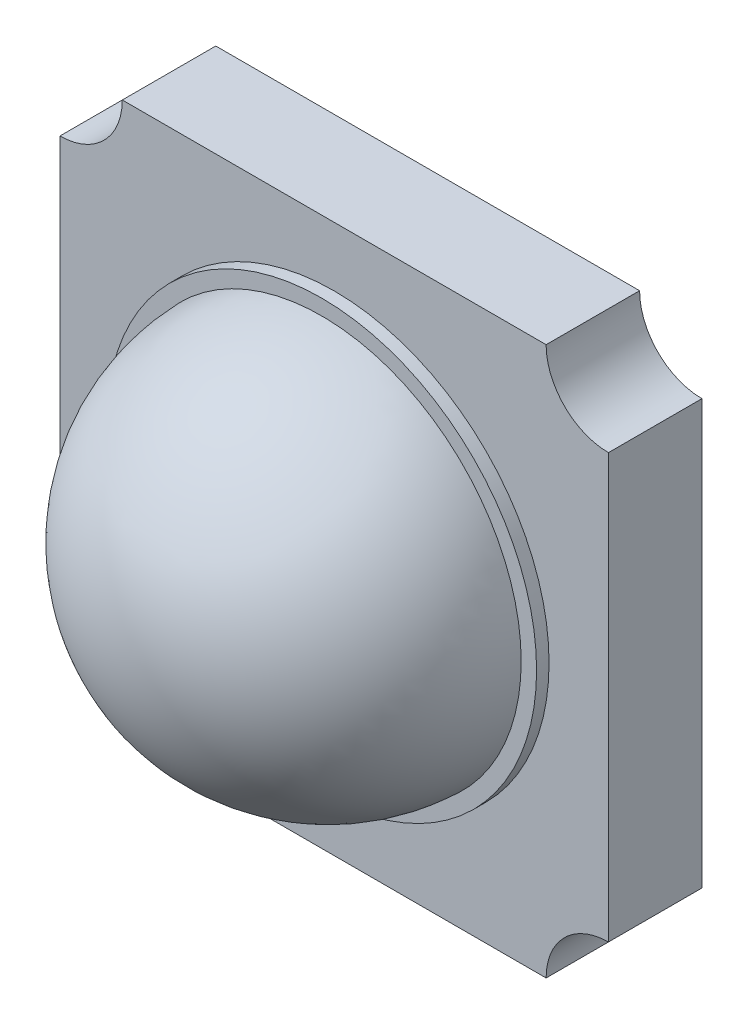
ISO-10303-21;
HEADER;
FILE_DESCRIPTION(('STEP AP214'),'2;1');
FILE_NAME('part.step','',(''),(''),'','','');
FILE_SCHEMA(('AUTOMOTIVE_DESIGN { 1 0 10303 214 1 1 1 1 }'));
ENDSEC;
DATA;
#1=APPLICATION_CONTEXT('core data for automotive mechanical design processes');
#2=APPLICATION_PROTOCOL_DEFINITION('international standard','automotive_design',2000,#1);
#3=PRODUCT_CONTEXT('',#1,'mechanical');
#4=PRODUCT('Part','Part','',(#3));
#5=PRODUCT_RELATED_PRODUCT_CATEGORY('part','',(#4));
#6=PRODUCT_DEFINITION_FORMATION('','',#4);
#7=PRODUCT_DEFINITION_CONTEXT('part definition',#1,'design');
#8=PRODUCT_DEFINITION('design','',#6,#7);
#9=PRODUCT_DEFINITION_SHAPE('','',#8);
#10=(LENGTH_UNIT() NAMED_UNIT(*) SI_UNIT(.MILLI.,.METRE.));
#11=(NAMED_UNIT(*) PLANE_ANGLE_UNIT() SI_UNIT($,.RADIAN.));
#12=(NAMED_UNIT(*) SI_UNIT($,.STERADIAN.) SOLID_ANGLE_UNIT());
#13=UNCERTAINTY_MEASURE_WITH_UNIT(LENGTH_MEASURE(1.E-05),#10,'distance_accuracy_value','');
#14=(GEOMETRIC_REPRESENTATION_CONTEXT(3) GLOBAL_UNCERTAINTY_ASSIGNED_CONTEXT((#13)) GLOBAL_UNIT_ASSIGNED_CONTEXT((#10,
#11,#12)) REPRESENTATION_CONTEXT('',''));
#15=CARTESIAN_POINT('',(0.,0.,0.));
#16=DIRECTION('',(0.,0.,1.));
#17=DIRECTION('',(1.,0.,0.));
#18=AXIS2_PLACEMENT_3D('',#15,#16,#17);
#19=CARTESIAN_POINT('',(-49.9513317458031,34.8792724196277,0.85));
#20=DIRECTION('',(0.,0.,1.));
#21=DIRECTION('',(1.,0.,0.));
#22=AXIS2_PLACEMENT_3D('',#19,#20,#21);
#23=PLANE('',#22);
#24=CARTESIAN_POINT('',(-49.9513317458031,34.8792724196277,0.85));
#25=DIRECTION('',(0.,0.,1.));
#26=DIRECTION('',(1.,0.,0.));
#27=AXIS2_PLACEMENT_3D('',#24,#25,#26);
#28=CIRCLE('',#27,1.72368180231581);
#29=CARTESIAN_POINT('',(-48.2276499434872,34.8792724196277,0.85));
#30=VERTEX_POINT('',#29);
#31=EDGE_CURVE('E137',#30,#30,#28,.T.);
#32=ORIENTED_EDGE('',*,*,#31,.T.);
#33=EDGE_LOOP('',(#32));
#34=FACE_BOUND('',#33,.T.);
#35=CARTESIAN_POINT('',(-49.9513317458031,34.8792724196277,0.85));
#36=DIRECTION('',(0.,0.,1.));
#37=DIRECTION('',(1.,0.,0.));
#38=AXIS2_PLACEMENT_3D('',#35,#36,#37);
#39=CIRCLE('',#38,1.6);
#40=CARTESIAN_POINT('',(-48.3513317458031,34.8792724196277,0.85));
#41=VERTEX_POINT('',#40);
#42=EDGE_CURVE('E161',#41,#41,#39,.F.);
#43=ORIENTED_EDGE('',*,*,#42,.T.);
#44=EDGE_LOOP('',(#43));
#45=FACE_BOUND('',#44,.T.);
#46=ADVANCED_FACE('F34',(#34,#45),#23,.T.);
#47=CARTESIAN_POINT('',(-47.7513317458031,37.0792724196277,0.75));
#48=DIRECTION('',(0.,0.,1.));
#49=DIRECTION('',(1.,0.,0.));
#50=AXIS2_PLACEMENT_3D('',#47,#48,#49);
#51=PLANE('',#50);
#52=CARTESIAN_POINT('',(-47.7513317458031,37.0792724196277,0.75));
#53=DIRECTION('',(0.,0.,-1.));
#54=DIRECTION('',(1.,0.,0.));
#55=AXIS2_PLACEMENT_3D('',#52,#53,#54);
#56=CIRCLE('',#55,0.499999999999997);
#57=CARTESIAN_POINT('',(-47.751331745803,36.5792724196277,0.75));
#58=VERTEX_POINT('',#57);
#59=CARTESIAN_POINT('',(-48.251331745803,37.0792724196277,0.75));
#60=VERTEX_POINT('',#59);
#61=EDGE_CURVE('E148',#58,#60,#56,.T.);
#62=ORIENTED_EDGE('',*,*,#61,.T.);
#63=DIRECTION('',(-1.,0.,0.));
#64=VECTOR('',#63,1.);
#65=CARTESIAN_POINT('',(-51.6513317458031,37.0792724196277,0.75));
#66=LINE('',#65,#64);
#67=CARTESIAN_POINT('',(-51.6513317458031,37.0792724196277,0.75));
#68=VERTEX_POINT('',#67);
#69=EDGE_CURVE('E95',#60,#68,#66,.T.);
#70=ORIENTED_EDGE('',*,*,#69,.T.);
#71=CARTESIAN_POINT('',(-52.1513317458031,37.0792724196277,0.75));
#72=DIRECTION('',(0.,0.,-1.));
#73=DIRECTION('',(-1.,0.,0.));
#74=AXIS2_PLACEMENT_3D('',#71,#72,#73);
#75=CIRCLE('',#74,0.5);
#76=CARTESIAN_POINT('',(-52.1513317458031,36.5792724196277,0.75));
#77=VERTEX_POINT('',#76);
#78=EDGE_CURVE('E175',#68,#77,#75,.T.);
#79=ORIENTED_EDGE('',*,*,#78,.T.);
#80=DIRECTION('',(0.,-1.,0.));
#81=VECTOR('',#80,1.);
#82=CARTESIAN_POINT('',(-52.1513317458031,36.5792724196277,0.75));
#83=LINE('',#82,#81);
#84=CARTESIAN_POINT('',(-52.151331745803,33.1792724196277,0.75));
#85=VERTEX_POINT('',#84);
#86=EDGE_CURVE('E177',#77,#85,#83,.T.);
#87=ORIENTED_EDGE('',*,*,#86,.T.);
#88=CARTESIAN_POINT('',(-52.151331745803,32.6792724196277,0.75));
#89=DIRECTION('',(0.,0.,-1.));
#90=DIRECTION('',(1.,0.,0.));
#91=AXIS2_PLACEMENT_3D('',#88,#89,#90);
#92=CIRCLE('',#91,0.499999999999994);
#93=CARTESIAN_POINT('',(-51.6513317458031,32.6792724196277,0.75));
#94=VERTEX_POINT('',#93);
#95=EDGE_CURVE('E115',#85,#94,#92,.T.);
#96=ORIENTED_EDGE('',*,*,#95,.T.);
#97=DIRECTION('',(1.,0.,0.));
#98=VECTOR('',#97,1.);
#99=CARTESIAN_POINT('',(-51.6513317458031,32.6792724196277,0.75));
#100=LINE('',#99,#98);
#101=CARTESIAN_POINT('',(-48.251331745803,32.6792724196277,0.75));
#102=VERTEX_POINT('',#101);
#103=EDGE_CURVE('E108',#94,#102,#100,.T.);
#104=ORIENTED_EDGE('',*,*,#103,.T.);
#105=CARTESIAN_POINT('',(-47.751331745803,32.6792724196277,0.75));
#106=DIRECTION('',(0.,0.,-1.));
#107=DIRECTION('',(1.,0.,0.));
#108=AXIS2_PLACEMENT_3D('',#105,#106,#107);
#109=CIRCLE('',#108,0.5);
#110=CARTESIAN_POINT('',(-47.751331745803,33.1792724196277,0.75));
#111=VERTEX_POINT('',#110);
#112=EDGE_CURVE('E113',#102,#111,#109,.T.);
#113=ORIENTED_EDGE('',*,*,#112,.T.);
#114=DIRECTION('',(0.,1.,0.));
#115=VECTOR('',#114,1.);
#116=CARTESIAN_POINT('',(-47.751331745803,33.1792724196277,0.75));
#117=LINE('',#116,#115);
#118=EDGE_CURVE('E51',#111,#58,#117,.T.);
#119=ORIENTED_EDGE('',*,*,#118,.T.);
#120=EDGE_LOOP('',(#62,#70,#79,#87,#96,#104,#113,#119));
#121=FACE_BOUND('',#120,.T.);
#122=CARTESIAN_POINT('',(-49.9513317458031,34.8792724196277,0.75));
#123=DIRECTION('',(0.,0.,1.));
#124=DIRECTION('',(1.,0.,0.));
#125=AXIS2_PLACEMENT_3D('',#122,#123,#124);
#126=CIRCLE('',#125,1.72368180231581);
#127=CARTESIAN_POINT('',(-48.2276499434872,34.8792724196277,0.75));
#128=VERTEX_POINT('',#127);
#129=EDGE_CURVE('E163',#128,#128,#126,.T.);
#130=ORIENTED_EDGE('',*,*,#129,.F.);
#131=EDGE_LOOP('',(#130));
#132=FACE_BOUND('',#131,.T.);
#133=ADVANCED_FACE('F110',(#121,#132),#51,.T.);
#134=CARTESIAN_POINT('',(-47.7513317458031,37.0792724196277,0.75));
#135=DIRECTION('',(0.,0.,-1.));
#136=DIRECTION('',(-1.,0.,0.));
#137=AXIS2_PLACEMENT_3D('',#134,#135,#136);
#138=CYLINDRICAL_SURFACE('',#137,0.499999999999997);
#139=CARTESIAN_POINT('',(-47.7513317458031,37.0792724196277,0.));
#140=DIRECTION('',(0.,0.,-1.));
#141=DIRECTION('',(1.,0.,0.));
#142=AXIS2_PLACEMENT_3D('',#139,#140,#141);
#143=CIRCLE('',#142,0.499999999999997);
#144=CARTESIAN_POINT('',(-47.751331745803,36.5792724196277,0.));
#145=VERTEX_POINT('',#144);
#146=CARTESIAN_POINT('',(-48.251331745803,37.0792724196277,0.));
#147=VERTEX_POINT('',#146);
#148=EDGE_CURVE('E133',#145,#147,#143,.T.);
#149=ORIENTED_EDGE('',*,*,#148,.T.);
#150=DIRECTION('',(0.,0.,-1.));
#151=VECTOR('',#150,1.);
#152=CARTESIAN_POINT('',(-48.251331745803,37.0792724196277,0.75));
#153=LINE('',#152,#151);
#154=EDGE_CURVE('E43',#60,#147,#153,.T.);
#155=ORIENTED_EDGE('',*,*,#154,.F.);
#156=ORIENTED_EDGE('',*,*,#61,.F.);
#157=DIRECTION('',(0.,0.,-1.));
#158=VECTOR('',#157,1.);
#159=CARTESIAN_POINT('',(-47.751331745803,36.5792724196277,0.75));
#160=LINE('',#159,#158);
#161=EDGE_CURVE('E129',#58,#145,#160,.T.);
#162=ORIENTED_EDGE('',*,*,#161,.T.);
#163=EDGE_LOOP('',(#149,#155,#156,#162));
#164=FACE_BOUND('',#163,.T.);
#165=ADVANCED_FACE('F194',(#164),#138,.F.);
#166=CARTESIAN_POINT('',(-51.6513317458031,37.0792724196277,0.75));
#167=DIRECTION('',(0.,-1.,0.));
#168=DIRECTION('',(0.,0.,-1.));
#169=AXIS2_PLACEMENT_3D('',#166,#167,#168);
#170=PLANE('',#169);
#171=DIRECTION('',(-1.,0.,0.));
#172=VECTOR('',#171,1.);
#173=CARTESIAN_POINT('',(-51.6513317458031,37.0792724196277,0.));
#174=LINE('',#173,#172);
#175=CARTESIAN_POINT('',(-51.6513317458031,37.0792724196277,0.));
#176=VERTEX_POINT('',#175);
#177=EDGE_CURVE('E136',#147,#176,#174,.T.);
#178=ORIENTED_EDGE('',*,*,#177,.T.);
#179=DIRECTION('',(0.,0.,-1.));
#180=VECTOR('',#179,1.);
#181=CARTESIAN_POINT('',(-51.6513317458031,37.0792724196277,0.75));
#182=LINE('',#181,#180);
#183=EDGE_CURVE('E158',#68,#176,#182,.T.);
#184=ORIENTED_EDGE('',*,*,#183,.F.);
#185=ORIENTED_EDGE('',*,*,#69,.F.);
#186=ORIENTED_EDGE('',*,*,#154,.T.);
#187=EDGE_LOOP('',(#178,#184,#185,#186));
#188=FACE_BOUND('',#187,.T.);
#189=ADVANCED_FACE('F305',(#188),#170,.F.);
#190=CARTESIAN_POINT('',(-52.1513317458031,37.0792724196277,0.75));
#191=DIRECTION('',(0.,0.,-1.));
#192=DIRECTION('',(-1.,0.,0.));
#193=AXIS2_PLACEMENT_3D('',#190,#191,#192);
#194=CYLINDRICAL_SURFACE('',#193,0.5);
#195=CARTESIAN_POINT('',(-52.1513317458031,37.0792724196277,0.));
#196=DIRECTION('',(0.,0.,-1.));
#197=DIRECTION('',(-1.,0.,0.));
#198=AXIS2_PLACEMENT_3D('',#195,#196,#197);
#199=CIRCLE('',#198,0.5);
#200=CARTESIAN_POINT('',(-52.1513317458031,36.5792724196277,0.));
#201=VERTEX_POINT('',#200);
#202=EDGE_CURVE('E139',#176,#201,#199,.T.);
#203=ORIENTED_EDGE('',*,*,#202,.T.);
#204=DIRECTION('',(0.,0.,-1.));
#205=VECTOR('',#204,1.);
#206=CARTESIAN_POINT('',(-52.1513317458031,36.5792724196277,0.75));
#207=LINE('',#206,#205);
#208=EDGE_CURVE('E155',#77,#201,#207,.T.);
#209=ORIENTED_EDGE('',*,*,#208,.F.);
#210=ORIENTED_EDGE('',*,*,#78,.F.);
#211=ORIENTED_EDGE('',*,*,#183,.T.);
#212=EDGE_LOOP('',(#203,#209,#210,#211));
#213=FACE_BOUND('',#212,.T.);
#214=ADVANCED_FACE('F296',(#213),#194,.F.);
#215=CARTESIAN_POINT('',(-52.1513317458031,36.5792724196277,0.75));
#216=DIRECTION('',(1.,0.,0.));
#217=DIRECTION('',(0.,1.,0.));
#218=AXIS2_PLACEMENT_3D('',#215,#216,#217);
#219=PLANE('',#218);
#220=DIRECTION('',(0.,-1.,0.));
#221=VECTOR('',#220,1.);
#222=CARTESIAN_POINT('',(-52.1513317458031,36.5792724196277,0.));
#223=LINE('',#222,#221);
#224=CARTESIAN_POINT('',(-52.151331745803,33.1792724196277,0.));
#225=VERTEX_POINT('',#224);
#226=EDGE_CURVE('E141',#201,#225,#223,.T.);
#227=ORIENTED_EDGE('',*,*,#226,.T.);
#228=DIRECTION('',(0.,0.,-1.));
#229=VECTOR('',#228,1.);
#230=CARTESIAN_POINT('',(-52.151331745803,33.1792724196277,0.75));
#231=LINE('',#230,#229);
#232=EDGE_CURVE('E152',#85,#225,#231,.T.);
#233=ORIENTED_EDGE('',*,*,#232,.F.);
#234=ORIENTED_EDGE('',*,*,#86,.F.);
#235=ORIENTED_EDGE('',*,*,#208,.T.);
#236=EDGE_LOOP('',(#227,#233,#234,#235));
#237=FACE_BOUND('',#236,.T.);
#238=ADVANCED_FACE('F183',(#237),#219,.F.);
#239=CARTESIAN_POINT('',(-52.151331745803,32.6792724196277,0.75));
#240=DIRECTION('',(0.,0.,-1.));
#241=DIRECTION('',(-1.,0.,0.));
#242=AXIS2_PLACEMENT_3D('',#239,#240,#241);
#243=CYLINDRICAL_SURFACE('',#242,0.499999999999994);
#244=CARTESIAN_POINT('',(-52.151331745803,32.6792724196277,0.));
#245=DIRECTION('',(0.,0.,-1.));
#246=DIRECTION('',(1.,0.,0.));
#247=AXIS2_PLACEMENT_3D('',#244,#245,#246);
#248=CIRCLE('',#247,0.499999999999994);
#249=CARTESIAN_POINT('',(-51.6513317458031,32.6792724196277,0.));
#250=VERTEX_POINT('',#249);
#251=EDGE_CURVE('E143',#225,#250,#248,.T.);
#252=ORIENTED_EDGE('',*,*,#251,.T.);
#253=DIRECTION('',(0.,0.,-1.));
#254=VECTOR('',#253,1.);
#255=CARTESIAN_POINT('',(-51.6513317458031,32.6792724196277,0.75));
#256=LINE('',#255,#254);
#257=EDGE_CURVE('E124',#94,#250,#256,.T.);
#258=ORIENTED_EDGE('',*,*,#257,.F.);
#259=ORIENTED_EDGE('',*,*,#95,.F.);
#260=ORIENTED_EDGE('',*,*,#232,.T.);
#261=EDGE_LOOP('',(#252,#258,#259,#260));
#262=FACE_BOUND('',#261,.T.);
#263=ADVANCED_FACE('F187',(#262),#243,.F.);
#264=CARTESIAN_POINT('',(-51.6513317458031,32.6792724196277,0.75));
#265=DIRECTION('',(0.,1.,0.));
#266=DIRECTION('',(0.,0.,1.));
#267=AXIS2_PLACEMENT_3D('',#264,#265,#266);
#268=PLANE('',#267);
#269=DIRECTION('',(1.,0.,0.));
#270=VECTOR('',#269,1.);
#271=CARTESIAN_POINT('',(-51.6513317458031,32.6792724196277,0.));
#272=LINE('',#271,#270);
#273=CARTESIAN_POINT('',(-48.251331745803,32.6792724196277,0.));
#274=VERTEX_POINT('',#273);
#275=EDGE_CURVE('E123',#250,#274,#272,.T.);
#276=ORIENTED_EDGE('',*,*,#275,.T.);
#277=DIRECTION('',(0.,0.,-1.));
#278=VECTOR('',#277,1.);
#279=CARTESIAN_POINT('',(-48.251331745803,32.6792724196277,0.75));
#280=LINE('',#279,#278);
#281=EDGE_CURVE('E120',#102,#274,#280,.T.);
#282=ORIENTED_EDGE('',*,*,#281,.F.);
#283=ORIENTED_EDGE('',*,*,#103,.F.);
#284=ORIENTED_EDGE('',*,*,#257,.T.);
#285=EDGE_LOOP('',(#276,#282,#283,#284));
#286=FACE_BOUND('',#285,.T.);
#287=ADVANCED_FACE('F121',(#286),#268,.F.);
#288=CARTESIAN_POINT('',(-47.751331745803,32.6792724196277,0.75));
#289=DIRECTION('',(0.,0.,-1.));
#290=DIRECTION('',(-1.,0.,0.));
#291=AXIS2_PLACEMENT_3D('',#288,#289,#290);
#292=CYLINDRICAL_SURFACE('',#291,0.5);
#293=CARTESIAN_POINT('',(-47.751331745803,32.6792724196277,0.));
#294=DIRECTION('',(0.,0.,-1.));
#295=DIRECTION('',(1.,0.,0.));
#296=AXIS2_PLACEMENT_3D('',#293,#294,#295);
#297=CIRCLE('',#296,0.5);
#298=CARTESIAN_POINT('',(-47.751331745803,33.1792724196277,0.));
#299=VERTEX_POINT('',#298);
#300=EDGE_CURVE('E80',#274,#299,#297,.T.);
#301=ORIENTED_EDGE('',*,*,#300,.T.);
#302=DIRECTION('',(0.,0.,-1.));
#303=VECTOR('',#302,1.);
#304=CARTESIAN_POINT('',(-47.751331745803,33.1792724196277,0.75));
#305=LINE('',#304,#303);
#306=EDGE_CURVE('E125',#111,#299,#305,.T.);
#307=ORIENTED_EDGE('',*,*,#306,.F.);
#308=ORIENTED_EDGE('',*,*,#112,.F.);
#309=ORIENTED_EDGE('',*,*,#281,.T.);
#310=EDGE_LOOP('',(#301,#307,#308,#309));
#311=FACE_BOUND('',#310,.T.);
#312=ADVANCED_FACE('F127',(#311),#292,.F.);
#313=CARTESIAN_POINT('',(-47.751331745803,33.1792724196277,0.75));
#314=DIRECTION('',(-1.,0.,0.));
#315=DIRECTION('',(0.,-1.,0.));
#316=AXIS2_PLACEMENT_3D('',#313,#314,#315);
#317=PLANE('',#316);
#318=DIRECTION('',(0.,1.,0.));
#319=VECTOR('',#318,1.);
#320=CARTESIAN_POINT('',(-47.751331745803,33.1792724196277,0.));
#321=LINE('',#320,#319);
#322=EDGE_CURVE('E86',#299,#145,#321,.T.);
#323=ORIENTED_EDGE('',*,*,#322,.T.);
#324=ORIENTED_EDGE('',*,*,#161,.F.);
#325=ORIENTED_EDGE('',*,*,#118,.F.);
#326=ORIENTED_EDGE('',*,*,#306,.T.);
#327=EDGE_LOOP('',(#323,#324,#325,#326));
#328=FACE_BOUND('',#327,.T.);
#329=ADVANCED_FACE('F196',(#328),#317,.F.);
#330=CARTESIAN_POINT('',(-47.7513317458031,37.0792724196277,0.));
#331=DIRECTION('',(0.,0.,1.));
#332=DIRECTION('',(1.,0.,0.));
#333=AXIS2_PLACEMENT_3D('',#330,#331,#332);
#334=PLANE('',#333);
#335=ORIENTED_EDGE('',*,*,#148,.F.);
#336=ORIENTED_EDGE('',*,*,#322,.F.);
#337=ORIENTED_EDGE('',*,*,#300,.F.);
#338=ORIENTED_EDGE('',*,*,#275,.F.);
#339=ORIENTED_EDGE('',*,*,#251,.F.);
#340=ORIENTED_EDGE('',*,*,#226,.F.);
#341=ORIENTED_EDGE('',*,*,#202,.F.);
#342=ORIENTED_EDGE('',*,*,#177,.F.);
#343=EDGE_LOOP('',(#335,#336,#337,#338,#339,#340,#341,#342));
#344=FACE_BOUND('',#343,.T.);
#345=ADVANCED_FACE('F190',(#344),#334,.F.);
#346=CARTESIAN_POINT('',(-49.9513317458031,34.8792724196277,0.85));
#347=DIRECTION('',(0.,0.,-1.));
#348=DIRECTION('',(-1.,0.,0.));
#349=AXIS2_PLACEMENT_3D('',#346,#347,#348);
#350=CYLINDRICAL_SURFACE('',#349,1.72368180231581);
#351=ORIENTED_EDGE('',*,*,#31,.F.);
#352=EDGE_LOOP('',(#351));
#353=FACE_BOUND('',#352,.T.);
#354=ORIENTED_EDGE('',*,*,#129,.T.);
#355=EDGE_LOOP('',(#354));
#356=FACE_BOUND('',#355,.T.);
#357=ADVANCED_FACE('F203',(#353,#356),#350,.T.);
#358=CARTESIAN_POINT('',(-49.9513317458031,34.8792724196277,2.4));
#359=DIRECTION('',(0.,0.,1.));
#360=DIRECTION('',(1.,0.,0.));
#361=AXIS2_PLACEMENT_3D('',#358,#359,#360);
#362=PLANE('',#361);
#363=CARTESIAN_POINT('',(-49.9513317458031,34.8792724196277,2.4));
#364=DIRECTION('',(0.,0.,1.));
#365=DIRECTION('',(1.,0.,0.));
#366=AXIS2_PLACEMENT_3D('',#363,#364,#365);
#367=CIRCLE('',#366,0.00078144082804989);
#368=CARTESIAN_POINT('',(-49.950550304975,34.8792724196277,2.4));
#369=VERTEX_POINT('',#368);
#370=EDGE_CURVE('E11',#369,#369,#367,.T.);
#371=ORIENTED_EDGE('',*,*,#370,.T.);
#372=EDGE_LOOP('',(#371));
#373=FACE_BOUND('',#372,.T.);
#374=ADVANCED_FACE('F215',(#373),#362,.T.);
#375=CARTESIAN_POINT('',(-49.9513317458031,34.8792724196277,0.8));
#376=DIRECTION('',(0.,0.,-1.));
#377=DIRECTION('',(-1.,0.,0.));
#378=AXIS2_PLACEMENT_3D('',#375,#376,#377);
#379=DEGENERATE_TOROIDAL_SURFACE('',#378,0.00078144082804989,1.6,.T.);
#380=ORIENTED_EDGE('',*,*,#42,.F.);
#381=EDGE_LOOP('',(#380));
#382=FACE_BOUND('',#381,.T.);
#383=ORIENTED_EDGE('',*,*,#370,.F.);
#384=EDGE_LOOP('',(#383));
#385=FACE_BOUND('',#384,.T.);
#386=ADVANCED_FACE('F36',(#382,#385),#379,.T.);
#387=CLOSED_SHELL('',(#46,#133,#165,#189,#214,#238,#263,#287,#312,#329,#345,#357,#374,#386));
#388=MANIFOLD_SOLID_BREP('B2',#387);
#389=ADVANCED_BREP_SHAPE_REPRESENTATION('',(#18,#388),#14);
#390=SHAPE_DEFINITION_REPRESENTATION(#9,#389);
ENDSEC;
END-ISO-10303-21;
